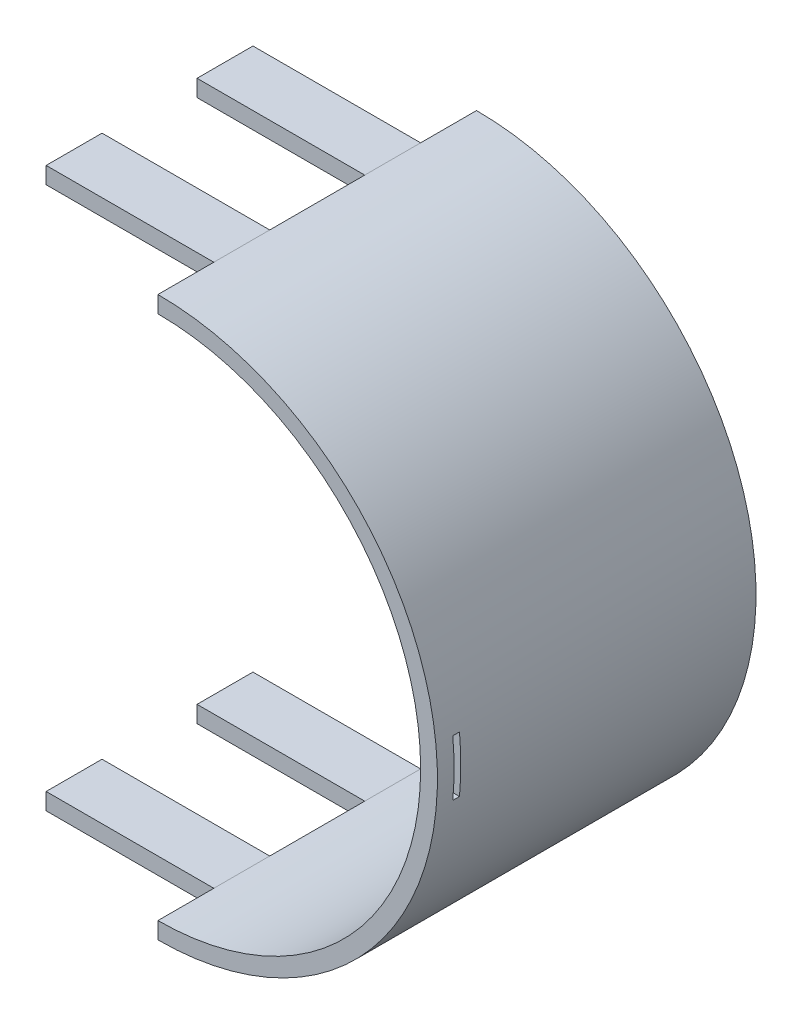
ISO-10303-21;
HEADER;
FILE_DESCRIPTION(('STEP AP214'),'2;1');
FILE_NAME('part.step','',(''),(''),'','','');
FILE_SCHEMA(('AUTOMOTIVE_DESIGN { 1 0 10303 214 1 1 1 1 }'));
ENDSEC;
DATA;
#1=APPLICATION_CONTEXT('core data for automotive mechanical design processes');
#2=APPLICATION_PROTOCOL_DEFINITION('international standard','automotive_design',2000,#1);
#3=PRODUCT_CONTEXT('',#1,'mechanical');
#4=PRODUCT('Part','Part','',(#3));
#5=PRODUCT_RELATED_PRODUCT_CATEGORY('part','',(#4));
#6=PRODUCT_DEFINITION_FORMATION('','',#4);
#7=PRODUCT_DEFINITION_CONTEXT('part definition',#1,'design');
#8=PRODUCT_DEFINITION('design','',#6,#7);
#9=PRODUCT_DEFINITION_SHAPE('','',#8);
#10=(LENGTH_UNIT() NAMED_UNIT(*) SI_UNIT(.MILLI.,.METRE.));
#11=(NAMED_UNIT(*) PLANE_ANGLE_UNIT() SI_UNIT($,.RADIAN.));
#12=(NAMED_UNIT(*) SI_UNIT($,.STERADIAN.) SOLID_ANGLE_UNIT());
#13=UNCERTAINTY_MEASURE_WITH_UNIT(LENGTH_MEASURE(1.E-05),#10,'distance_accuracy_value','');
#14=(GEOMETRIC_REPRESENTATION_CONTEXT(3) GLOBAL_UNCERTAINTY_ASSIGNED_CONTEXT((#13)) GLOBAL_UNIT_ASSIGNED_CONTEXT((#10,
#11,#12)) REPRESENTATION_CONTEXT('',''));
#15=CARTESIAN_POINT('',(0.,0.,0.));
#16=DIRECTION('',(0.,0.,1.));
#17=DIRECTION('',(1.,0.,0.));
#18=AXIS2_PLACEMENT_3D('',#15,#16,#17);
#19=CARTESIAN_POINT('',(350.01,-5.00000000000006,55.8));
#20=DIRECTION('',(0.,-1.,0.));
#21=DIRECTION('',(0.,0.,-1.));
#22=AXIS2_PLACEMENT_3D('',#19,#20,#21);
#23=PLANE('',#22);
#24=DIRECTION('',(-1.,0.,0.));
#25=VECTOR('',#24,1.);
#26=CARTESIAN_POINT('',(350.01,-5.00000000000005,57.));
#27=LINE('',#26,#25);
#28=CARTESIAN_POINT('',(349.749371855331,-5.00000000000005,57.));
#29=VERTEX_POINT('',#28);
#30=CARTESIAN_POINT('',(346.733285782192,-5.00000000000005,57.));
#31=VERTEX_POINT('',#30);
#32=EDGE_CURVE('E374',#29,#31,#27,.T.);
#33=ORIENTED_EDGE('',*,*,#32,.F.);
#34=DIRECTION('',(0.,0.,-1.));
#35=VECTOR('',#34,1.);
#36=CARTESIAN_POINT('',(349.749371855331,-5.00000000000005,60.));
#37=LINE('',#36,#35);
#38=CARTESIAN_POINT('',(349.749371855331,-5.00000000000006,55.8));
#39=VERTEX_POINT('',#38);
#40=EDGE_CURVE('E57',#29,#39,#37,.T.);
#41=ORIENTED_EDGE('',*,*,#40,.T.);
#42=DIRECTION('',(-1.,0.,0.));
#43=VECTOR('',#42,1.);
#44=CARTESIAN_POINT('',(350.01,-5.00000000000006,55.8));
#45=LINE('',#44,#43);
#46=CARTESIAN_POINT('',(346.733285782192,-5.00000000000006,55.8));
#47=VERTEX_POINT('',#46);
#48=EDGE_CURVE('E378',#39,#47,#45,.T.);
#49=ORIENTED_EDGE('',*,*,#48,.T.);
#50=DIRECTION('',(0.,0.,1.));
#51=VECTOR('',#50,1.);
#52=CARTESIAN_POINT('',(346.733285782192,-5.00000000000017,3.00000000000001));
#53=LINE('',#52,#51);
#54=EDGE_CURVE('E39',#31,#47,#53,.F.);
#55=ORIENTED_EDGE('',*,*,#54,.F.);
#56=EDGE_LOOP('',(#33,#41,#49,#55));
#57=FACE_BOUND('',#56,.T.);
#58=ADVANCED_FACE('F35',(#57),#23,.F.);
#59=CARTESIAN_POINT('',(350.01,-1.03769581311591E-13,55.8));
#60=DIRECTION('',(0.,0.,-1.));
#61=DIRECTION('',(0.,1.,0.));
#62=AXIS2_PLACEMENT_3D('',#59,#60,#61);
#63=PLANE('',#62);
#64=ORIENTED_EDGE('',*,*,#48,.F.);
#65=CARTESIAN_POINT('',(300.,0.,55.8));
#66=DIRECTION('',(0.,0.,-1.));
#67=DIRECTION('',(0.,1.,0.));
#68=AXIS2_PLACEMENT_3D('',#65,#66,#67);
#69=CIRCLE('',#68,50.);
#70=CARTESIAN_POINT('',(349.749371855331,4.99999999999994,55.8));
#71=VERTEX_POINT('',#70);
#72=EDGE_CURVE('E384',#39,#71,#69,.F.);
#73=ORIENTED_EDGE('',*,*,#72,.T.);
#74=DIRECTION('',(-1.,0.,0.));
#75=VECTOR('',#74,1.);
#76=CARTESIAN_POINT('',(350.01,4.99999999999994,55.8));
#77=LINE('',#76,#75);
#78=CARTESIAN_POINT('',(346.733285782192,5.00000000000006,55.8));
#79=VERTEX_POINT('',#78);
#80=EDGE_CURVE('E44',#71,#79,#77,.T.);
#81=ORIENTED_EDGE('',*,*,#80,.T.);
#82=CARTESIAN_POINT('',(300.,0.,55.8));
#83=DIRECTION('',(0.,0.,-1.));
#84=DIRECTION('',(0.,1.,0.));
#85=AXIS2_PLACEMENT_3D('',#82,#83,#84);
#86=CIRCLE('',#85,47.);
#87=EDGE_CURVE('E392',#47,#79,#86,.F.);
#88=ORIENTED_EDGE('',*,*,#87,.F.);
#89=EDGE_LOOP('',(#64,#73,#81,#88));
#90=FACE_BOUND('',#89,.T.);
#91=ADVANCED_FACE('F37',(#90),#63,.F.);
#92=CARTESIAN_POINT('',(350.01,-1.03769581311591E-13,57.));
#93=DIRECTION('',(0.,0.,1.));
#94=DIRECTION('',(1.,0.,0.));
#95=AXIS2_PLACEMENT_3D('',#92,#93,#94);
#96=PLANE('',#95);
#97=DIRECTION('',(-1.,0.,0.));
#98=VECTOR('',#97,1.);
#99=CARTESIAN_POINT('',(350.01,4.99999999999994,57.));
#100=LINE('',#99,#98);
#101=CARTESIAN_POINT('',(349.749371855331,4.99999999999994,57.));
#102=VERTEX_POINT('',#101);
#103=CARTESIAN_POINT('',(346.733285782192,5.00000000000006,57.));
#104=VERTEX_POINT('',#103);
#105=EDGE_CURVE('E11',#102,#104,#100,.T.);
#106=ORIENTED_EDGE('',*,*,#105,.F.);
#107=CARTESIAN_POINT('',(300.,0.,57.));
#108=DIRECTION('',(0.,0.,1.));
#109=DIRECTION('',(1.,0.,0.));
#110=AXIS2_PLACEMENT_3D('',#107,#108,#109);
#111=CIRCLE('',#110,50.);
#112=EDGE_CURVE('E52',#102,#29,#111,.F.);
#113=ORIENTED_EDGE('',*,*,#112,.T.);
#114=ORIENTED_EDGE('',*,*,#32,.T.);
#115=CARTESIAN_POINT('',(300.,0.,57.));
#116=DIRECTION('',(0.,0.,1.));
#117=DIRECTION('',(1.,0.,0.));
#118=AXIS2_PLACEMENT_3D('',#115,#116,#117);
#119=CIRCLE('',#118,47.);
#120=EDGE_CURVE('E390',#104,#31,#119,.F.);
#121=ORIENTED_EDGE('',*,*,#120,.F.);
#122=EDGE_LOOP('',(#106,#113,#114,#121));
#123=FACE_BOUND('',#122,.T.);
#124=ADVANCED_FACE('F405',(#123),#96,.F.);
#125=CARTESIAN_POINT('',(350.01,4.99999999999994,55.8));
#126=DIRECTION('',(0.,1.,0.));
#127=DIRECTION('',(0.,0.,1.));
#128=AXIS2_PLACEMENT_3D('',#125,#126,#127);
#129=PLANE('',#128);
#130=ORIENTED_EDGE('',*,*,#80,.F.);
#131=DIRECTION('',(0.,0.,-1.));
#132=VECTOR('',#131,1.);
#133=CARTESIAN_POINT('',(349.749371855331,4.99999999999994,60.));
#134=LINE('',#133,#132);
#135=EDGE_CURVE('E381',#71,#102,#134,.F.);
#136=ORIENTED_EDGE('',*,*,#135,.T.);
#137=ORIENTED_EDGE('',*,*,#105,.T.);
#138=DIRECTION('',(0.,0.,1.));
#139=VECTOR('',#138,1.);
#140=CARTESIAN_POINT('',(346.733285782192,5.00000000000006,3.00000000000001));
#141=LINE('',#140,#139);
#142=EDGE_CURVE('E368',#79,#104,#141,.T.);
#143=ORIENTED_EDGE('',*,*,#142,.F.);
#144=EDGE_LOOP('',(#130,#136,#137,#143));
#145=FACE_BOUND('',#144,.T.);
#146=ADVANCED_FACE('F403',(#145),#129,.F.);
#147=CARTESIAN_POINT('',(300.,0.,60.));
#148=DIRECTION('',(0.,0.,-1.));
#149=DIRECTION('',(-1.,0.,0.));
#150=AXIS2_PLACEMENT_3D('',#147,#148,#149);
#151=CYLINDRICAL_SURFACE('',#150,50.);
#152=DIRECTION('',(0.,0.,-1.));
#153=VECTOR('',#152,1.);
#154=CARTESIAN_POINT('',(300.,-50.,60.));
#155=LINE('',#154,#153);
#156=CARTESIAN_POINT('',(300.,-50.,60.));
#157=VERTEX_POINT('',#156);
#158=CARTESIAN_POINT('',(300.,-50.,50.));
#159=VERTEX_POINT('',#158);
#160=EDGE_CURVE('E343',#157,#159,#155,.T.);
#161=ORIENTED_EDGE('',*,*,#160,.T.);
#162=DIRECTION('',(0.,0.,-1.));
#163=VECTOR('',#162,1.);
#164=CARTESIAN_POINT('',(300.,-50.,60.));
#165=LINE('',#164,#163);
#166=CARTESIAN_POINT('',(300.,-50.,40.));
#167=VERTEX_POINT('',#166);
#168=EDGE_CURVE('E279',#159,#167,#165,.T.);
#169=ORIENTED_EDGE('',*,*,#168,.T.);
#170=CARTESIAN_POINT('',(300.,-50.,23.));
#171=VERTEX_POINT('',#170);
#172=EDGE_CURVE('E353',#167,#171,#155,.T.);
#173=ORIENTED_EDGE('',*,*,#172,.T.);
#174=DIRECTION('',(0.,0.,-1.));
#175=VECTOR('',#174,1.);
#176=CARTESIAN_POINT('',(300.,-50.,60.));
#177=LINE('',#176,#175);
#178=CARTESIAN_POINT('',(300.,-50.,13.));
#179=VERTEX_POINT('',#178);
#180=EDGE_CURVE('E241',#171,#179,#177,.T.);
#181=ORIENTED_EDGE('',*,*,#180,.T.);
#182=CARTESIAN_POINT('',(300.,-50.,3.));
#183=VERTEX_POINT('',#182);
#184=EDGE_CURVE('E354',#179,#183,#155,.T.);
#185=ORIENTED_EDGE('',*,*,#184,.T.);
#186=CARTESIAN_POINT('',(300.,0.,3.));
#187=DIRECTION('',(0.,0.,1.));
#188=DIRECTION('',(1.,0.,0.));
#189=AXIS2_PLACEMENT_3D('',#186,#187,#188);
#190=CIRCLE('',#189,50.);
#191=CARTESIAN_POINT('',(300.,50.,3.));
#192=VERTEX_POINT('',#191);
#193=EDGE_CURVE('E347',#183,#192,#190,.T.);
#194=ORIENTED_EDGE('',*,*,#193,.T.);
#195=DIRECTION('',(0.,0.,-1.));
#196=VECTOR('',#195,1.);
#197=CARTESIAN_POINT('',(300.,50.,60.));
#198=LINE('',#197,#196);
#199=CARTESIAN_POINT('',(300.,50.,13.));
#200=VERTEX_POINT('',#199);
#201=EDGE_CURVE('E209',#200,#192,#198,.T.);
#202=ORIENTED_EDGE('',*,*,#201,.F.);
#203=DIRECTION('',(0.,0.,-1.));
#204=VECTOR('',#203,1.);
#205=CARTESIAN_POINT('',(300.,50.,60.));
#206=LINE('',#205,#204);
#207=CARTESIAN_POINT('',(300.,50.,23.));
#208=VERTEX_POINT('',#207);
#209=EDGE_CURVE('E213',#208,#200,#206,.T.);
#210=ORIENTED_EDGE('',*,*,#209,.F.);
#211=CARTESIAN_POINT('',(300.,50.,40.));
#212=VERTEX_POINT('',#211);
#213=EDGE_CURVE('E197',#212,#208,#198,.T.);
#214=ORIENTED_EDGE('',*,*,#213,.F.);
#215=DIRECTION('',(0.,0.,-1.));
#216=VECTOR('',#215,1.);
#217=CARTESIAN_POINT('',(300.,50.,60.));
#218=LINE('',#217,#216);
#219=CARTESIAN_POINT('',(300.,50.,50.));
#220=VERTEX_POINT('',#219);
#221=EDGE_CURVE('E317',#220,#212,#218,.T.);
#222=ORIENTED_EDGE('',*,*,#221,.F.);
#223=CARTESIAN_POINT('',(300.,50.,60.));
#224=VERTEX_POINT('',#223);
#225=EDGE_CURVE('E208',#224,#220,#198,.T.);
#226=ORIENTED_EDGE('',*,*,#225,.F.);
#227=CARTESIAN_POINT('',(300.,0.,60.));
#228=DIRECTION('',(0.,0.,1.));
#229=DIRECTION('',(1.,0.,0.));
#230=AXIS2_PLACEMENT_3D('',#227,#228,#229);
#231=CIRCLE('',#230,50.);
#232=EDGE_CURVE('E340',#157,#224,#231,.T.);
#233=ORIENTED_EDGE('',*,*,#232,.F.);
#234=EDGE_LOOP('',(#161,#169,#173,#181,#185,#194,#202,#210,#214,#222,#226,#233));
#235=FACE_BOUND('',#234,.T.);
#236=ORIENTED_EDGE('',*,*,#40,.F.);
#237=ORIENTED_EDGE('',*,*,#112,.F.);
#238=ORIENTED_EDGE('',*,*,#135,.F.);
#239=ORIENTED_EDGE('',*,*,#72,.F.);
#240=EDGE_LOOP('',(#236,#237,#238,#239));
#241=FACE_BOUND('',#240,.T.);
#242=ADVANCED_FACE('F216',(#235,#241),#151,.T.);
#243=CARTESIAN_POINT('',(300.,47.,3.));
#244=DIRECTION('',(0.,1.,0.));
#245=DIRECTION('',(0.,0.,1.));
#246=AXIS2_PLACEMENT_3D('',#243,#244,#245);
#247=PLANE('',#246);
#248=DIRECTION('',(-1.,0.,0.));
#249=VECTOR('',#248,1.);
#250=CARTESIAN_POINT('',(300.,47.,13.));
#251=LINE('',#250,#249);
#252=CARTESIAN_POINT('',(300.,47.,13.));
#253=VERTEX_POINT('',#252);
#254=CARTESIAN_POINT('',(270.,47.,13.));
#255=VERTEX_POINT('',#254);
#256=EDGE_CURVE('E222',#253,#255,#251,.T.);
#257=ORIENTED_EDGE('',*,*,#256,.F.);
#258=DIRECTION('',(0.,0.,1.));
#259=VECTOR('',#258,1.);
#260=CARTESIAN_POINT('',(300.,47.,3.));
#261=LINE('',#260,#259);
#262=CARTESIAN_POINT('',(300.,47.,23.));
#263=VERTEX_POINT('',#262);
#264=EDGE_CURVE('E221',#253,#263,#261,.T.);
#265=ORIENTED_EDGE('',*,*,#264,.T.);
#266=DIRECTION('',(1.,0.,0.));
#267=VECTOR('',#266,1.);
#268=CARTESIAN_POINT('',(300.,47.,23.));
#269=LINE('',#268,#267);
#270=CARTESIAN_POINT('',(270.,47.,23.));
#271=VERTEX_POINT('',#270);
#272=EDGE_CURVE('E236',#271,#263,#269,.T.);
#273=ORIENTED_EDGE('',*,*,#272,.F.);
#274=DIRECTION('',(0.,0.,1.));
#275=VECTOR('',#274,1.);
#276=CARTESIAN_POINT('',(270.,47.,3.));
#277=LINE('',#276,#275);
#278=EDGE_CURVE('E760',#255,#271,#277,.T.);
#279=ORIENTED_EDGE('',*,*,#278,.F.);
#280=EDGE_LOOP('',(#257,#265,#273,#279));
#281=FACE_BOUND('',#280,.T.);
#282=ADVANCED_FACE('F442',(#281),#247,.F.);
#283=CARTESIAN_POINT('',(300.,47.,3.));
#284=DIRECTION('',(0.,1.,0.));
#285=DIRECTION('',(0.,0.,1.));
#286=AXIS2_PLACEMENT_3D('',#283,#284,#285);
#287=PLANE('',#286);
#288=DIRECTION('',(-1.,0.,0.));
#289=VECTOR('',#288,1.);
#290=CARTESIAN_POINT('',(300.,47.,40.));
#291=LINE('',#290,#289);
#292=CARTESIAN_POINT('',(300.,47.,40.));
#293=VERTEX_POINT('',#292);
#294=CARTESIAN_POINT('',(270.,47.,40.));
#295=VERTEX_POINT('',#294);
#296=EDGE_CURVE('E319',#293,#295,#291,.T.);
#297=ORIENTED_EDGE('',*,*,#296,.F.);
#298=DIRECTION('',(0.,0.,1.));
#299=VECTOR('',#298,1.);
#300=CARTESIAN_POINT('',(300.,47.,3.));
#301=LINE('',#300,#299);
#302=CARTESIAN_POINT('',(300.,47.,50.));
#303=VERTEX_POINT('',#302);
#304=EDGE_CURVE('E312',#293,#303,#301,.T.);
#305=ORIENTED_EDGE('',*,*,#304,.T.);
#306=DIRECTION('',(1.,0.,0.));
#307=VECTOR('',#306,1.);
#308=CARTESIAN_POINT('',(300.,47.,50.));
#309=LINE('',#308,#307);
#310=CARTESIAN_POINT('',(270.,47.,50.));
#311=VERTEX_POINT('',#310);
#312=EDGE_CURVE('E325',#311,#303,#309,.T.);
#313=ORIENTED_EDGE('',*,*,#312,.F.);
#314=DIRECTION('',(0.,0.,1.));
#315=VECTOR('',#314,1.);
#316=CARTESIAN_POINT('',(270.,47.,3.));
#317=LINE('',#316,#315);
#318=EDGE_CURVE('E322',#295,#311,#317,.T.);
#319=ORIENTED_EDGE('',*,*,#318,.F.);
#320=EDGE_LOOP('',(#297,#305,#313,#319));
#321=FACE_BOUND('',#320,.T.);
#322=ADVANCED_FACE('F686',(#321),#287,.F.);
#323=CARTESIAN_POINT('',(-300.,-47.,3.));
#324=DIRECTION('',(0.,-1.,0.));
#325=DIRECTION('',(0.,0.,-1.));
#326=AXIS2_PLACEMENT_3D('',#323,#324,#325);
#327=PLANE('',#326);
#328=DIRECTION('',(1.,0.,0.));
#329=VECTOR('',#328,1.);
#330=CARTESIAN_POINT('',(-300.,-47.,40.));
#331=LINE('',#330,#329);
#332=CARTESIAN_POINT('',(270.,-47.,40.));
#333=VERTEX_POINT('',#332);
#334=CARTESIAN_POINT('',(300.,-47.,40.));
#335=VERTEX_POINT('',#334);
#336=EDGE_CURVE('E294',#333,#335,#331,.T.);
#337=ORIENTED_EDGE('',*,*,#336,.F.);
#338=DIRECTION('',(0.,0.,-1.));
#339=VECTOR('',#338,1.);
#340=CARTESIAN_POINT('',(270.,-47.,3.));
#341=LINE('',#340,#339);
#342=CARTESIAN_POINT('',(270.,-47.,50.));
#343=VERTEX_POINT('',#342);
#344=EDGE_CURVE('E291',#343,#333,#341,.T.);
#345=ORIENTED_EDGE('',*,*,#344,.F.);
#346=DIRECTION('',(-1.,0.,0.));
#347=VECTOR('',#346,1.);
#348=CARTESIAN_POINT('',(-300.,-47.,50.));
#349=LINE('',#348,#347);
#350=CARTESIAN_POINT('',(300.,-47.,50.));
#351=VERTEX_POINT('',#350);
#352=EDGE_CURVE('E290',#351,#343,#349,.T.);
#353=ORIENTED_EDGE('',*,*,#352,.F.);
#354=DIRECTION('',(0.,0.,1.));
#355=VECTOR('',#354,1.);
#356=CARTESIAN_POINT('',(300.,-47.,3.));
#357=LINE('',#356,#355);
#358=EDGE_CURVE('E276',#335,#351,#357,.T.);
#359=ORIENTED_EDGE('',*,*,#358,.F.);
#360=EDGE_LOOP('',(#337,#345,#353,#359));
#361=FACE_BOUND('',#360,.T.);
#362=ADVANCED_FACE('F688',(#361),#327,.F.);
#363=CARTESIAN_POINT('',(-300.,-47.,3.));
#364=DIRECTION('',(0.,-1.,0.));
#365=DIRECTION('',(0.,0.,-1.));
#366=AXIS2_PLACEMENT_3D('',#363,#364,#365);
#367=PLANE('',#366);
#368=DIRECTION('',(1.,0.,0.));
#369=VECTOR('',#368,1.);
#370=CARTESIAN_POINT('',(-300.,-47.,13.));
#371=LINE('',#370,#369);
#372=CARTESIAN_POINT('',(270.,-47.,13.));
#373=VERTEX_POINT('',#372);
#374=CARTESIAN_POINT('',(300.,-47.,13.));
#375=VERTEX_POINT('',#374);
#376=EDGE_CURVE('E261',#373,#375,#371,.T.);
#377=ORIENTED_EDGE('',*,*,#376,.F.);
#378=DIRECTION('',(0.,0.,-1.));
#379=VECTOR('',#378,1.);
#380=CARTESIAN_POINT('',(270.,-47.,3.));
#381=LINE('',#380,#379);
#382=CARTESIAN_POINT('',(270.,-47.,23.));
#383=VERTEX_POINT('',#382);
#384=EDGE_CURVE('E258',#383,#373,#381,.T.);
#385=ORIENTED_EDGE('',*,*,#384,.F.);
#386=DIRECTION('',(-1.,0.,0.));
#387=VECTOR('',#386,1.);
#388=CARTESIAN_POINT('',(-300.,-47.,23.));
#389=LINE('',#388,#387);
#390=CARTESIAN_POINT('',(300.,-47.,23.));
#391=VERTEX_POINT('',#390);
#392=EDGE_CURVE('E255',#391,#383,#389,.T.);
#393=ORIENTED_EDGE('',*,*,#392,.F.);
#394=DIRECTION('',(0.,0.,1.));
#395=VECTOR('',#394,1.);
#396=CARTESIAN_POINT('',(300.,-47.,3.));
#397=LINE('',#396,#395);
#398=EDGE_CURVE('E245',#375,#391,#397,.T.);
#399=ORIENTED_EDGE('',*,*,#398,.F.);
#400=EDGE_LOOP('',(#377,#385,#393,#399));
#401=FACE_BOUND('',#400,.T.);
#402=ADVANCED_FACE('F701',(#401),#367,.F.);
#403=CARTESIAN_POINT('',(270.,-50.01,13.));
#404=DIRECTION('',(-1.,0.,0.));
#405=DIRECTION('',(0.,0.,1.));
#406=AXIS2_PLACEMENT_3D('',#403,#404,#405);
#407=PLANE('',#406);
#408=DIRECTION('',(0.,1.,0.));
#409=VECTOR('',#408,1.);
#410=CARTESIAN_POINT('',(270.,-50.01,13.));
#411=LINE('',#410,#409);
#412=CARTESIAN_POINT('',(270.,-50.,13.));
#413=VERTEX_POINT('',#412);
#414=EDGE_CURVE('E244',#413,#373,#411,.T.);
#415=ORIENTED_EDGE('',*,*,#414,.F.);
#416=DIRECTION('',(0.,0.,1.));
#417=VECTOR('',#416,1.);
#418=CARTESIAN_POINT('',(270.,-50.,60.));
#419=LINE('',#418,#417);
#420=CARTESIAN_POINT('',(270.,-50.,23.));
#421=VERTEX_POINT('',#420);
#422=EDGE_CURVE('E267',#413,#421,#419,.T.);
#423=ORIENTED_EDGE('',*,*,#422,.T.);
#424=DIRECTION('',(0.,1.,0.));
#425=VECTOR('',#424,1.);
#426=CARTESIAN_POINT('',(270.,-50.01,23.));
#427=LINE('',#426,#425);
#428=EDGE_CURVE('E273',#421,#383,#427,.T.);
#429=ORIENTED_EDGE('',*,*,#428,.T.);
#430=ORIENTED_EDGE('',*,*,#384,.T.);
#431=EDGE_LOOP('',(#415,#423,#429,#430));
#432=FACE_BOUND('',#431,.T.);
#433=ADVANCED_FACE('F457',(#432),#407,.T.);
#434=CARTESIAN_POINT('',(300.,-50.01,23.));
#435=DIRECTION('',(0.,0.,1.));
#436=DIRECTION('',(1.,0.,0.));
#437=AXIS2_PLACEMENT_3D('',#434,#435,#436);
#438=PLANE('',#437);
#439=ORIENTED_EDGE('',*,*,#428,.F.);
#440=DIRECTION('',(1.,0.,0.));
#441=VECTOR('',#440,1.);
#442=CARTESIAN_POINT('',(-300.,-50.,23.));
#443=LINE('',#442,#441);
#444=EDGE_CURVE('E264',#421,#171,#443,.T.);
#445=ORIENTED_EDGE('',*,*,#444,.T.);
#446=DIRECTION('',(0.,1.,0.));
#447=VECTOR('',#446,1.);
#448=CARTESIAN_POINT('',(300.,1.71683972880179E-13,23.));
#449=LINE('',#448,#447);
#450=EDGE_CURVE('E248',#171,#391,#449,.T.);
#451=ORIENTED_EDGE('',*,*,#450,.T.);
#452=ORIENTED_EDGE('',*,*,#392,.T.);
#453=EDGE_LOOP('',(#439,#445,#451,#452));
#454=FACE_BOUND('',#453,.T.);
#455=ADVANCED_FACE('F451',(#454),#438,.T.);
#456=CARTESIAN_POINT('',(300.,-50.01,13.));
#457=DIRECTION('',(0.,0.,-1.));
#458=DIRECTION('',(-1.,0.,0.));
#459=AXIS2_PLACEMENT_3D('',#456,#457,#458);
#460=PLANE('',#459);
#461=DIRECTION('',(0.,-1.,0.));
#462=VECTOR('',#461,1.);
#463=CARTESIAN_POINT('',(300.,1.71683972880179E-13,13.));
#464=LINE('',#463,#462);
#465=EDGE_CURVE('E251',#375,#179,#464,.T.);
#466=ORIENTED_EDGE('',*,*,#465,.T.);
#467=DIRECTION('',(-1.,0.,0.));
#468=VECTOR('',#467,1.);
#469=CARTESIAN_POINT('',(-300.,-50.,13.));
#470=LINE('',#469,#468);
#471=EDGE_CURVE('E247',#179,#413,#470,.T.);
#472=ORIENTED_EDGE('',*,*,#471,.T.);
#473=ORIENTED_EDGE('',*,*,#414,.T.);
#474=ORIENTED_EDGE('',*,*,#376,.T.);
#475=EDGE_LOOP('',(#466,#472,#473,#474));
#476=FACE_BOUND('',#475,.T.);
#477=ADVANCED_FACE('F456',(#476),#460,.T.);
#478=CARTESIAN_POINT('',(-300.,-50.,60.));
#479=DIRECTION('',(0.,1.,0.));
#480=DIRECTION('',(0.,0.,1.));
#481=AXIS2_PLACEMENT_3D('',#478,#479,#480);
#482=PLANE('',#481);
#483=ORIENTED_EDGE('',*,*,#471,.F.);
#484=ORIENTED_EDGE('',*,*,#180,.F.);
#485=ORIENTED_EDGE('',*,*,#444,.F.);
#486=ORIENTED_EDGE('',*,*,#422,.F.);
#487=EDGE_LOOP('',(#483,#484,#485,#486));
#488=FACE_BOUND('',#487,.T.);
#489=ADVANCED_FACE('F470',(#488),#482,.F.);
#490=CARTESIAN_POINT('',(300.,1.71683972880179E-13,0.));
#491=DIRECTION('',(-1.,0.,0.));
#492=DIRECTION('',(0.,-1.,0.));
#493=AXIS2_PLACEMENT_3D('',#490,#491,#492);
#494=PLANE('',#493);
#495=ORIENTED_EDGE('',*,*,#465,.F.);
#496=DIRECTION('',(0.,0.,1.));
#497=VECTOR('',#496,1.);
#498=CARTESIAN_POINT('',(300.,-47.,3.));
#499=LINE('',#498,#497);
#500=CARTESIAN_POINT('',(300.,-47.,3.));
#501=VERTEX_POINT('',#500);
#502=EDGE_CURVE('E348',#501,#375,#499,.T.);
#503=ORIENTED_EDGE('',*,*,#502,.F.);
#504=DIRECTION('',(0.,1.,0.));
#505=VECTOR('',#504,1.);
#506=CARTESIAN_POINT('',(300.,1.71683972880179E-13,3.));
#507=LINE('',#506,#505);
#508=EDGE_CURVE('E365',#183,#501,#507,.T.);
#509=ORIENTED_EDGE('',*,*,#508,.F.);
#510=ORIENTED_EDGE('',*,*,#184,.F.);
#511=EDGE_LOOP('',(#495,#503,#509,#510));
#512=FACE_BOUND('',#511,.T.);
#513=ADVANCED_FACE('F481',(#512),#494,.T.);
#514=CARTESIAN_POINT('',(0.,0.,3.));
#515=DIRECTION('',(0.,0.,1.));
#516=DIRECTION('',(1.,0.,0.));
#517=AXIS2_PLACEMENT_3D('',#514,#515,#516);
#518=PLANE('',#517);
#519=DIRECTION('',(0.,1.,0.));
#520=VECTOR('',#519,1.);
#521=CARTESIAN_POINT('',(300.,1.71683972880179E-13,3.));
#522=LINE('',#521,#520);
#523=CARTESIAN_POINT('',(300.,47.,3.));
#524=VERTEX_POINT('',#523);
#525=EDGE_CURVE('E369',#524,#192,#522,.T.);
#526=ORIENTED_EDGE('',*,*,#525,.T.);
#527=ORIENTED_EDGE('',*,*,#193,.F.);
#528=ORIENTED_EDGE('',*,*,#508,.T.);
#529=CARTESIAN_POINT('',(300.,0.,3.));
#530=DIRECTION('',(0.,0.,1.));
#531=DIRECTION('',(1.,0.,0.));
#532=AXIS2_PLACEMENT_3D('',#529,#530,#531);
#533=CIRCLE('',#532,47.);
#534=EDGE_CURVE('E364',#524,#501,#533,.F.);
#535=ORIENTED_EDGE('',*,*,#534,.F.);
#536=EDGE_LOOP('',(#526,#527,#528,#535));
#537=FACE_BOUND('',#536,.T.);
#538=ADVANCED_FACE('F492',(#537),#518,.F.);
#539=CARTESIAN_POINT('',(300.,0.,3.));
#540=DIRECTION('',(0.,0.,1.));
#541=DIRECTION('',(1.,0.,0.));
#542=AXIS2_PLACEMENT_3D('',#539,#540,#541);
#543=CYLINDRICAL_SURFACE('',#542,47.);
#544=ORIENTED_EDGE('',*,*,#120,.T.);
#545=ORIENTED_EDGE('',*,*,#54,.T.);
#546=ORIENTED_EDGE('',*,*,#87,.T.);
#547=ORIENTED_EDGE('',*,*,#142,.T.);
#548=EDGE_LOOP('',(#544,#545,#546,#547));
#549=FACE_BOUND('',#548,.T.);
#550=DIRECTION('',(0.,0.,1.));
#551=VECTOR('',#550,1.);
#552=CARTESIAN_POINT('',(300.,47.,3.));
#553=LINE('',#552,#551);
#554=EDGE_CURVE('E355',#524,#253,#553,.T.);
#555=ORIENTED_EDGE('',*,*,#554,.F.);
#556=ORIENTED_EDGE('',*,*,#534,.T.);
#557=ORIENTED_EDGE('',*,*,#502,.T.);
#558=ORIENTED_EDGE('',*,*,#398,.T.);
#559=EDGE_CURVE('E351',#391,#335,#499,.T.);
#560=ORIENTED_EDGE('',*,*,#559,.T.);
#561=ORIENTED_EDGE('',*,*,#358,.T.);
#562=CARTESIAN_POINT('',(300.,-47.,60.));
#563=VERTEX_POINT('',#562);
#564=EDGE_CURVE('E342',#351,#563,#499,.T.);
#565=ORIENTED_EDGE('',*,*,#564,.T.);
#566=CARTESIAN_POINT('',(300.,0.,60.));
#567=DIRECTION('',(0.,0.,1.));
#568=DIRECTION('',(1.,0.,0.));
#569=AXIS2_PLACEMENT_3D('',#566,#567,#568);
#570=CIRCLE('',#569,47.);
#571=CARTESIAN_POINT('',(300.,47.,60.));
#572=VERTEX_POINT('',#571);
#573=EDGE_CURVE('E344',#563,#572,#570,.T.);
#574=ORIENTED_EDGE('',*,*,#573,.T.);
#575=EDGE_CURVE('E314',#303,#572,#553,.T.);
#576=ORIENTED_EDGE('',*,*,#575,.F.);
#577=ORIENTED_EDGE('',*,*,#304,.F.);
#578=EDGE_CURVE('E357',#263,#293,#553,.T.);
#579=ORIENTED_EDGE('',*,*,#578,.F.);
#580=ORIENTED_EDGE('',*,*,#264,.F.);
#581=EDGE_LOOP('',(#555,#556,#557,#558,#560,#561,#565,#574,#576,#577,#579,#580));
#582=FACE_BOUND('',#581,.T.);
#583=ADVANCED_FACE('F396',(#549,#582),#543,.F.);
#584=CARTESIAN_POINT('',(-300.,0.,60.));
#585=DIRECTION('',(0.,0.,1.));
#586=DIRECTION('',(1.,0.,0.));
#587=AXIS2_PLACEMENT_3D('',#584,#585,#586);
#588=PLANE('',#587);
#589=ORIENTED_EDGE('',*,*,#232,.T.);
#590=DIRECTION('',(0.,-1.,0.));
#591=VECTOR('',#590,1.);
#592=CARTESIAN_POINT('',(300.,3.43367945760358E-13,60.));
#593=LINE('',#592,#591);
#594=EDGE_CURVE('E359',#224,#572,#593,.T.);
#595=ORIENTED_EDGE('',*,*,#594,.T.);
#596=ORIENTED_EDGE('',*,*,#573,.F.);
#597=EDGE_CURVE('E362',#563,#157,#593,.T.);
#598=ORIENTED_EDGE('',*,*,#597,.T.);
#599=EDGE_LOOP('',(#589,#595,#596,#598));
#600=FACE_BOUND('',#599,.T.);
#601=ADVANCED_FACE('F514',(#600),#588,.T.);
#602=CARTESIAN_POINT('',(270.,-50.01,40.));
#603=DIRECTION('',(-1.,0.,0.));
#604=DIRECTION('',(0.,0.,1.));
#605=AXIS2_PLACEMENT_3D('',#602,#603,#604);
#606=PLANE('',#605);
#607=DIRECTION('',(0.,1.,0.));
#608=VECTOR('',#607,1.);
#609=CARTESIAN_POINT('',(270.,-50.01,40.));
#610=LINE('',#609,#608);
#611=CARTESIAN_POINT('',(270.,-50.,40.));
#612=VERTEX_POINT('',#611);
#613=EDGE_CURVE('E282',#612,#333,#610,.T.);
#614=ORIENTED_EDGE('',*,*,#613,.F.);
#615=DIRECTION('',(0.,0.,1.));
#616=VECTOR('',#615,1.);
#617=CARTESIAN_POINT('',(270.,-50.,60.));
#618=LINE('',#617,#616);
#619=CARTESIAN_POINT('',(270.,-50.,50.));
#620=VERTEX_POINT('',#619);
#621=EDGE_CURVE('E302',#612,#620,#618,.T.);
#622=ORIENTED_EDGE('',*,*,#621,.T.);
#623=DIRECTION('',(0.,1.,0.));
#624=VECTOR('',#623,1.);
#625=CARTESIAN_POINT('',(270.,-50.01,50.));
#626=LINE('',#625,#624);
#627=EDGE_CURVE('E275',#620,#343,#626,.T.);
#628=ORIENTED_EDGE('',*,*,#627,.T.);
#629=ORIENTED_EDGE('',*,*,#344,.T.);
#630=EDGE_LOOP('',(#614,#622,#628,#629));
#631=FACE_BOUND('',#630,.T.);
#632=ADVANCED_FACE('F523',(#631),#606,.T.);
#633=CARTESIAN_POINT('',(300.,-50.01,50.));
#634=DIRECTION('',(0.,0.,1.));
#635=DIRECTION('',(1.,0.,0.));
#636=AXIS2_PLACEMENT_3D('',#633,#634,#635);
#637=PLANE('',#636);
#638=ORIENTED_EDGE('',*,*,#627,.F.);
#639=DIRECTION('',(1.,0.,0.));
#640=VECTOR('',#639,1.);
#641=CARTESIAN_POINT('',(-300.,-50.,50.));
#642=LINE('',#641,#640);
#643=EDGE_CURVE('E299',#620,#159,#642,.T.);
#644=ORIENTED_EDGE('',*,*,#643,.T.);
#645=DIRECTION('',(0.,1.,0.));
#646=VECTOR('',#645,1.);
#647=CARTESIAN_POINT('',(300.,1.71683972880179E-13,50.));
#648=LINE('',#647,#646);
#649=EDGE_CURVE('E283',#159,#351,#648,.T.);
#650=ORIENTED_EDGE('',*,*,#649,.T.);
#651=ORIENTED_EDGE('',*,*,#352,.T.);
#652=EDGE_LOOP('',(#638,#644,#650,#651));
#653=FACE_BOUND('',#652,.T.);
#654=ADVANCED_FACE('F531',(#653),#637,.T.);
#655=CARTESIAN_POINT('',(300.,-50.01,40.));
#656=DIRECTION('',(0.,0.,-1.));
#657=DIRECTION('',(-1.,0.,0.));
#658=AXIS2_PLACEMENT_3D('',#655,#656,#657);
#659=PLANE('',#658);
#660=DIRECTION('',(0.,-1.,0.));
#661=VECTOR('',#660,1.);
#662=CARTESIAN_POINT('',(300.,1.71683972880179E-13,40.));
#663=LINE('',#662,#661);
#664=EDGE_CURVE('E287',#335,#167,#663,.T.);
#665=ORIENTED_EDGE('',*,*,#664,.T.);
#666=DIRECTION('',(-1.,0.,0.));
#667=VECTOR('',#666,1.);
#668=CARTESIAN_POINT('',(-300.,-50.,40.));
#669=LINE('',#668,#667);
#670=EDGE_CURVE('E278',#167,#612,#669,.T.);
#671=ORIENTED_EDGE('',*,*,#670,.T.);
#672=ORIENTED_EDGE('',*,*,#613,.T.);
#673=ORIENTED_EDGE('',*,*,#336,.T.);
#674=EDGE_LOOP('',(#665,#671,#672,#673));
#675=FACE_BOUND('',#674,.T.);
#676=ADVANCED_FACE('F536',(#675),#659,.T.);
#677=CARTESIAN_POINT('',(-300.,-50.,60.));
#678=DIRECTION('',(0.,1.,0.));
#679=DIRECTION('',(0.,0.,1.));
#680=AXIS2_PLACEMENT_3D('',#677,#678,#679);
#681=PLANE('',#680);
#682=ORIENTED_EDGE('',*,*,#670,.F.);
#683=ORIENTED_EDGE('',*,*,#168,.F.);
#684=ORIENTED_EDGE('',*,*,#643,.F.);
#685=ORIENTED_EDGE('',*,*,#621,.F.);
#686=EDGE_LOOP('',(#682,#683,#684,#685));
#687=FACE_BOUND('',#686,.T.);
#688=ADVANCED_FACE('F547',(#687),#681,.F.);
#689=ORIENTED_EDGE('',*,*,#649,.F.);
#690=ORIENTED_EDGE('',*,*,#160,.F.);
#691=ORIENTED_EDGE('',*,*,#597,.F.);
#692=ORIENTED_EDGE('',*,*,#564,.F.);
#693=EDGE_LOOP('',(#689,#690,#691,#692));
#694=FACE_BOUND('',#693,.T.);
#695=ADVANCED_FACE('F558',(#694),#494,.T.);
#696=CARTESIAN_POINT('',(300.,46.99,50.));
#697=DIRECTION('',(0.,0.,1.));
#698=DIRECTION('',(1.,0.,0.));
#699=AXIS2_PLACEMENT_3D('',#696,#697,#698);
#700=PLANE('',#699);
#701=DIRECTION('',(0.,1.,0.));
#702=VECTOR('',#701,1.);
#703=CARTESIAN_POINT('',(270.,46.99,50.));
#704=LINE('',#703,#702);
#705=CARTESIAN_POINT('',(270.,50.,50.));
#706=VERTEX_POINT('',#705);
#707=EDGE_CURVE('E311',#311,#706,#704,.T.);
#708=ORIENTED_EDGE('',*,*,#707,.F.);
#709=ORIENTED_EDGE('',*,*,#312,.T.);
#710=DIRECTION('',(0.,1.,0.));
#711=VECTOR('',#710,1.);
#712=CARTESIAN_POINT('',(300.,1.71683972880179E-13,50.));
#713=LINE('',#712,#711);
#714=EDGE_CURVE('E286',#303,#220,#713,.T.);
#715=ORIENTED_EDGE('',*,*,#714,.T.);
#716=DIRECTION('',(-1.,0.,0.));
#717=VECTOR('',#716,1.);
#718=CARTESIAN_POINT('',(-300.,50.,50.));
#719=LINE('',#718,#717);
#720=EDGE_CURVE('E334',#220,#706,#719,.T.);
#721=ORIENTED_EDGE('',*,*,#720,.T.);
#722=EDGE_LOOP('',(#708,#709,#715,#721));
#723=FACE_BOUND('',#722,.T.);
#724=ADVANCED_FACE('F569',(#723),#700,.T.);
#725=CARTESIAN_POINT('',(270.,46.99,40.));
#726=DIRECTION('',(-1.,0.,0.));
#727=DIRECTION('',(0.,0.,1.));
#728=AXIS2_PLACEMENT_3D('',#725,#726,#727);
#729=PLANE('',#728);
#730=DIRECTION('',(0.,1.,0.));
#731=VECTOR('',#730,1.);
#732=CARTESIAN_POINT('',(270.,46.99,40.));
#733=LINE('',#732,#731);
#734=CARTESIAN_POINT('',(270.,50.,40.));
#735=VERTEX_POINT('',#734);
#736=EDGE_CURVE('E309',#295,#735,#733,.T.);
#737=ORIENTED_EDGE('',*,*,#736,.F.);
#738=ORIENTED_EDGE('',*,*,#318,.T.);
#739=ORIENTED_EDGE('',*,*,#707,.T.);
#740=DIRECTION('',(0.,0.,-1.));
#741=VECTOR('',#740,1.);
#742=CARTESIAN_POINT('',(270.,50.,60.));
#743=LINE('',#742,#741);
#744=EDGE_CURVE('E331',#706,#735,#743,.T.);
#745=ORIENTED_EDGE('',*,*,#744,.T.);
#746=EDGE_LOOP('',(#737,#738,#739,#745));
#747=FACE_BOUND('',#746,.T.);
#748=ADVANCED_FACE('F580',(#747),#729,.T.);
#749=CARTESIAN_POINT('',(300.,46.99,40.));
#750=DIRECTION('',(0.,0.,-1.));
#751=DIRECTION('',(-1.,0.,0.));
#752=AXIS2_PLACEMENT_3D('',#749,#750,#751);
#753=PLANE('',#752);
#754=DIRECTION('',(0.,-1.,0.));
#755=VECTOR('',#754,1.);
#756=CARTESIAN_POINT('',(300.,1.71683972880179E-13,40.));
#757=LINE('',#756,#755);
#758=EDGE_CURVE('E204',#212,#293,#757,.T.);
#759=ORIENTED_EDGE('',*,*,#758,.T.);
#760=ORIENTED_EDGE('',*,*,#296,.T.);
#761=ORIENTED_EDGE('',*,*,#736,.T.);
#762=DIRECTION('',(1.,0.,0.));
#763=VECTOR('',#762,1.);
#764=CARTESIAN_POINT('',(-300.,50.,40.));
#765=LINE('',#764,#763);
#766=EDGE_CURVE('E328',#735,#212,#765,.T.);
#767=ORIENTED_EDGE('',*,*,#766,.T.);
#768=EDGE_LOOP('',(#759,#760,#761,#767));
#769=FACE_BOUND('',#768,.T.);
#770=ADVANCED_FACE('F589',(#769),#753,.T.);
#771=CARTESIAN_POINT('',(-300.,50.,60.));
#772=DIRECTION('',(0.,-1.,0.));
#773=DIRECTION('',(0.,0.,-1.));
#774=AXIS2_PLACEMENT_3D('',#771,#772,#773);
#775=PLANE('',#774);
#776=ORIENTED_EDGE('',*,*,#766,.F.);
#777=ORIENTED_EDGE('',*,*,#744,.F.);
#778=ORIENTED_EDGE('',*,*,#720,.F.);
#779=ORIENTED_EDGE('',*,*,#221,.T.);
#780=EDGE_LOOP('',(#776,#777,#778,#779));
#781=FACE_BOUND('',#780,.T.);
#782=ADVANCED_FACE('F594',(#781),#775,.F.);
#783=ORIENTED_EDGE('',*,*,#714,.F.);
#784=ORIENTED_EDGE('',*,*,#575,.T.);
#785=ORIENTED_EDGE('',*,*,#594,.F.);
#786=ORIENTED_EDGE('',*,*,#225,.T.);
#787=EDGE_LOOP('',(#783,#784,#785,#786));
#788=FACE_BOUND('',#787,.T.);
#789=ADVANCED_FACE('F571',(#788),#494,.T.);
#790=CARTESIAN_POINT('',(300.,46.99,23.));
#791=DIRECTION('',(0.,0.,1.));
#792=DIRECTION('',(1.,0.,0.));
#793=AXIS2_PLACEMENT_3D('',#790,#791,#792);
#794=PLANE('',#793);
#795=DIRECTION('',(0.,1.,0.));
#796=VECTOR('',#795,1.);
#797=CARTESIAN_POINT('',(270.,46.99,23.));
#798=LINE('',#797,#796);
#799=CARTESIAN_POINT('',(270.,50.,23.));
#800=VERTEX_POINT('',#799);
#801=EDGE_CURVE('E252',#271,#800,#798,.T.);
#802=ORIENTED_EDGE('',*,*,#801,.F.);
#803=ORIENTED_EDGE('',*,*,#272,.T.);
#804=DIRECTION('',(0.,1.,0.));
#805=VECTOR('',#804,1.);
#806=CARTESIAN_POINT('',(300.,1.71683972880179E-13,23.));
#807=LINE('',#806,#805);
#808=EDGE_CURVE('E201',#263,#208,#807,.T.);
#809=ORIENTED_EDGE('',*,*,#808,.T.);
#810=DIRECTION('',(-1.,0.,0.));
#811=VECTOR('',#810,1.);
#812=CARTESIAN_POINT('',(-300.,50.,23.));
#813=LINE('',#812,#811);
#814=EDGE_CURVE('E226',#208,#800,#813,.T.);
#815=ORIENTED_EDGE('',*,*,#814,.T.);
#816=EDGE_LOOP('',(#802,#803,#809,#815));
#817=FACE_BOUND('',#816,.T.);
#818=ADVANCED_FACE('F234',(#817),#794,.T.);
#819=CARTESIAN_POINT('',(270.,46.99,13.));
#820=DIRECTION('',(-1.,0.,0.));
#821=DIRECTION('',(0.,0.,1.));
#822=AXIS2_PLACEMENT_3D('',#819,#820,#821);
#823=PLANE('',#822);
#824=DIRECTION('',(0.,1.,0.));
#825=VECTOR('',#824,1.);
#826=CARTESIAN_POINT('',(270.,46.99,13.));
#827=LINE('',#826,#825);
#828=CARTESIAN_POINT('',(270.,50.,13.));
#829=VERTEX_POINT('',#828);
#830=EDGE_CURVE('E766',#255,#829,#827,.T.);
#831=ORIENTED_EDGE('',*,*,#830,.F.);
#832=ORIENTED_EDGE('',*,*,#278,.T.);
#833=ORIENTED_EDGE('',*,*,#801,.T.);
#834=DIRECTION('',(0.,0.,-1.));
#835=VECTOR('',#834,1.);
#836=CARTESIAN_POINT('',(270.,50.,60.));
#837=LINE('',#836,#835);
#838=EDGE_CURVE('E229',#800,#829,#837,.T.);
#839=ORIENTED_EDGE('',*,*,#838,.T.);
#840=EDGE_LOOP('',(#831,#832,#833,#839));
#841=FACE_BOUND('',#840,.T.);
#842=ADVANCED_FACE('F624',(#841),#823,.T.);
#843=CARTESIAN_POINT('',(300.,46.99,13.));
#844=DIRECTION('',(0.,0.,-1.));
#845=DIRECTION('',(-1.,0.,0.));
#846=AXIS2_PLACEMENT_3D('',#843,#844,#845);
#847=PLANE('',#846);
#848=DIRECTION('',(0.,-1.,0.));
#849=VECTOR('',#848,1.);
#850=CARTESIAN_POINT('',(300.,1.71683972880179E-13,13.));
#851=LINE('',#850,#849);
#852=EDGE_CURVE('E231',#200,#253,#851,.T.);
#853=ORIENTED_EDGE('',*,*,#852,.T.);
#854=ORIENTED_EDGE('',*,*,#256,.T.);
#855=ORIENTED_EDGE('',*,*,#830,.T.);
#856=DIRECTION('',(1.,0.,0.));
#857=VECTOR('',#856,1.);
#858=CARTESIAN_POINT('',(-300.,50.,13.));
#859=LINE('',#858,#857);
#860=EDGE_CURVE('E762',#829,#200,#859,.T.);
#861=ORIENTED_EDGE('',*,*,#860,.T.);
#862=EDGE_LOOP('',(#853,#854,#855,#861));
#863=FACE_BOUND('',#862,.T.);
#864=ADVANCED_FACE('F632',(#863),#847,.T.);
#865=CARTESIAN_POINT('',(-300.,50.,60.));
#866=DIRECTION('',(0.,-1.,0.));
#867=DIRECTION('',(0.,0.,-1.));
#868=AXIS2_PLACEMENT_3D('',#865,#866,#867);
#869=PLANE('',#868);
#870=ORIENTED_EDGE('',*,*,#860,.F.);
#871=ORIENTED_EDGE('',*,*,#838,.F.);
#872=ORIENTED_EDGE('',*,*,#814,.F.);
#873=ORIENTED_EDGE('',*,*,#209,.T.);
#874=EDGE_LOOP('',(#870,#871,#872,#873));
#875=FACE_BOUND('',#874,.T.);
#876=ADVANCED_FACE('F227',(#875),#869,.F.);
#877=ORIENTED_EDGE('',*,*,#808,.F.);
#878=ORIENTED_EDGE('',*,*,#578,.T.);
#879=ORIENTED_EDGE('',*,*,#758,.F.);
#880=ORIENTED_EDGE('',*,*,#213,.T.);
#881=EDGE_LOOP('',(#877,#878,#879,#880));
#882=FACE_BOUND('',#881,.T.);
#883=ADVANCED_FACE('F199',(#882),#494,.T.);
#884=ORIENTED_EDGE('',*,*,#852,.F.);
#885=ORIENTED_EDGE('',*,*,#201,.T.);
#886=ORIENTED_EDGE('',*,*,#525,.F.);
#887=ORIENTED_EDGE('',*,*,#554,.T.);
#888=EDGE_LOOP('',(#884,#885,#886,#887));
#889=FACE_BOUND('',#888,.T.);
#890=ADVANCED_FACE('F495',(#889),#494,.T.);
#891=ORIENTED_EDGE('',*,*,#450,.F.);
#892=ORIENTED_EDGE('',*,*,#172,.F.);
#893=ORIENTED_EDGE('',*,*,#664,.F.);
#894=ORIENTED_EDGE('',*,*,#559,.F.);
#895=EDGE_LOOP('',(#891,#892,#893,#894));
#896=FACE_BOUND('',#895,.T.);
#897=ADVANCED_FACE('F444',(#896),#494,.T.);
#898=CLOSED_SHELL('',(#58,#91,#124,#146,#242,#282,#322,#362,#402,#433,#455,#477,#489,#513,#538,
#583,#601,#632,#654,#676,#688,#695,#724,#748,#770,#782,#789,#818,#842,#864,#876,#883,#890,#897));
#899=MANIFOLD_SOLID_BREP('B2',#898);
#900=ADVANCED_BREP_SHAPE_REPRESENTATION('',(#18,#899),#14);
#901=SHAPE_DEFINITION_REPRESENTATION(#9,#900);
ENDSEC;
END-ISO-10303-21;
